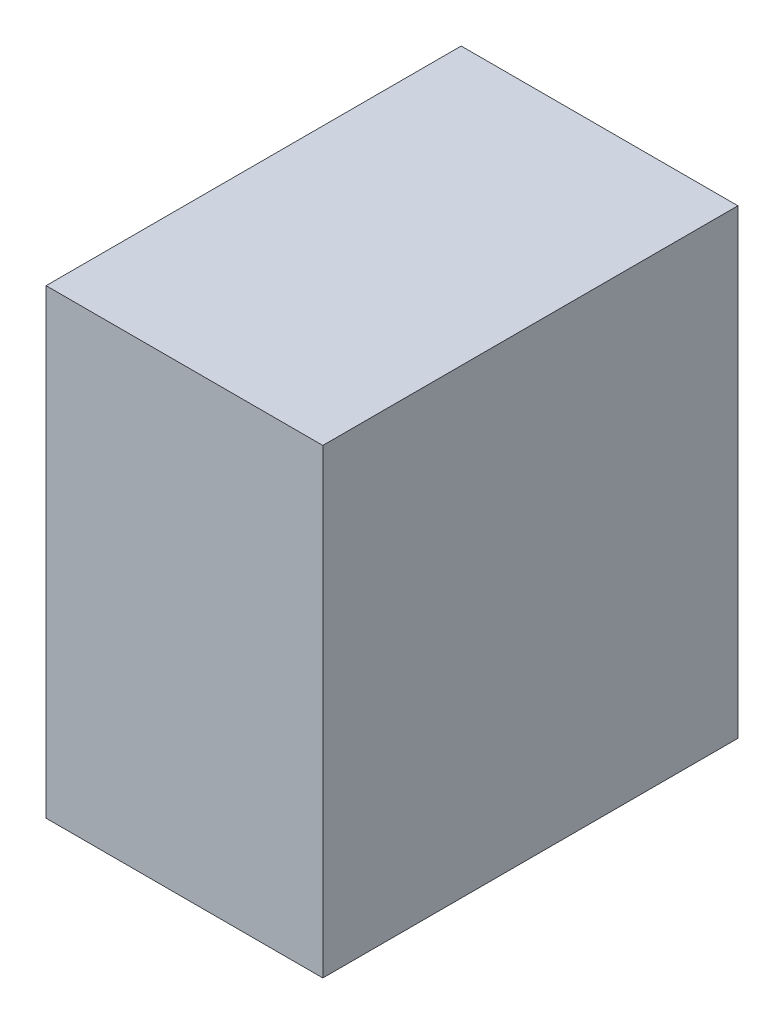
ISO-10303-21;
HEADER;
FILE_DESCRIPTION(('STEP AP214'),'2;1');
FILE_NAME('part.step','',(''),(''),'','','');
FILE_SCHEMA(('AUTOMOTIVE_DESIGN { 1 0 10303 214 1 1 1 1 }'));
ENDSEC;
DATA;
#1=APPLICATION_CONTEXT('core data for automotive mechanical design processes');
#2=APPLICATION_PROTOCOL_DEFINITION('international standard','automotive_design',2000,#1);
#3=PRODUCT_CONTEXT('',#1,'mechanical');
#4=PRODUCT('Part','Part','',(#3));
#5=PRODUCT_RELATED_PRODUCT_CATEGORY('part','',(#4));
#6=PRODUCT_DEFINITION_FORMATION('','',#4);
#7=PRODUCT_DEFINITION_CONTEXT('part definition',#1,'design');
#8=PRODUCT_DEFINITION('design','',#6,#7);
#9=PRODUCT_DEFINITION_SHAPE('','',#8);
#10=(LENGTH_UNIT() NAMED_UNIT(*) SI_UNIT(.MILLI.,.METRE.));
#11=(NAMED_UNIT(*) PLANE_ANGLE_UNIT() SI_UNIT($,.RADIAN.));
#12=(NAMED_UNIT(*) SI_UNIT($,.STERADIAN.) SOLID_ANGLE_UNIT());
#13=UNCERTAINTY_MEASURE_WITH_UNIT(LENGTH_MEASURE(1.E-05),#10,'distance_accuracy_value','');
#14=(GEOMETRIC_REPRESENTATION_CONTEXT(3) GLOBAL_UNCERTAINTY_ASSIGNED_CONTEXT((#13)) GLOBAL_UNIT_ASSIGNED_CONTEXT((#10,
#11,#12)) REPRESENTATION_CONTEXT('',''));
#15=CARTESIAN_POINT('',(0.,0.,0.));
#16=DIRECTION('',(0.,0.,1.));
#17=DIRECTION('',(1.,0.,0.));
#18=AXIS2_PLACEMENT_3D('',#15,#16,#17);
#19=CARTESIAN_POINT('',(3.3,-1.8000002141858,-3.30112167835709));
#20=DIRECTION('',(1.,0.,0.));
#21=DIRECTION('',(0.,1.,8.74227765734759E-08));
#22=AXIS2_PLACEMENT_3D('',#19,#20,#21);
#23=PLANE('',#22);
#24=DIRECTION('',(0.,0.999999999999996,8.74227765733007E-08));
#25=VECTOR('',#24,1.);
#26=CARTESIAN_POINT('',(3.3,-1.75000021855694,-3.25112167398595));
#27=LINE('',#26,#25);
#28=CARTESIAN_POINT('',(3.300000000001,-1.75000021855594,-3.25112167398595));
#29=VERTEX_POINT('',#28);
#30=CARTESIAN_POINT('',(3.300000000001,-0.750000218554942,-3.25112158656218));
#31=VERTEX_POINT('',#30);
#32=EDGE_CURVE('E11',#29,#31,#27,.T.);
#33=ORIENTED_EDGE('',*,*,#32,.F.);
#34=DIRECTION('',(0.,8.7422776672162E-08,-0.999999999999996));
#35=VECTOR('',#34,1.);
#36=CARTESIAN_POINT('',(3.3,-1.75000029723744,-2.35112167398595));
#37=LINE('',#36,#35);
#38=CARTESIAN_POINT('',(3.300000000001,-1.75000029723744,-2.35112167398695));
#39=VERTEX_POINT('',#38);
#40=EDGE_CURVE('E59',#39,#29,#37,.T.);
#41=ORIENTED_EDGE('',*,*,#40,.F.);
#42=DIRECTION('',(0.,-0.999999999999996,-8.74227765733007E-08));
#43=VECTOR('',#42,1.);
#44=CARTESIAN_POINT('',(3.3,-0.75000029723544,-2.35112158656318));
#45=LINE('',#44,#43);
#46=CARTESIAN_POINT('',(3.300000000001,-0.75000029723644,-2.35112158656318));
#47=VERTEX_POINT('',#46);
#48=EDGE_CURVE('E79',#47,#39,#45,.T.);
#49=ORIENTED_EDGE('',*,*,#48,.F.);
#50=DIRECTION('',(0.,-8.74227765488039E-08,0.999999999999996));
#51=VECTOR('',#50,1.);
#52=CARTESIAN_POINT('',(3.3,-0.750000218554942,-3.25112158656318));
#53=LINE('',#52,#51);
#54=EDGE_CURVE('E84',#31,#47,#53,.T.);
#55=ORIENTED_EDGE('',*,*,#54,.F.);
#56=EDGE_LOOP('',(#33,#41,#49,#55));
#57=FACE_BOUND('',#56,.T.);
#58=ADVANCED_FACE('F17',(#57),#23,.F.);
#59=CARTESIAN_POINT('',(3.9,-1.8000002141858,-3.30112167835709));
#60=DIRECTION('',(1.,0.,0.));
#61=DIRECTION('',(0.,1.,8.74227765734759E-08));
#62=AXIS2_PLACEMENT_3D('',#59,#60,#61);
#63=PLANE('',#62);
#64=DIRECTION('',(0.,-8.74227771655945E-08,0.999999999999996));
#65=VECTOR('',#64,1.);
#66=CARTESIAN_POINT('',(3.9,-0.750000218554941,-3.25112158656318));
#67=LINE('',#66,#65);
#68=CARTESIAN_POINT('',(3.899999999999,-0.750000218554942,-3.25112158656218));
#69=VERTEX_POINT('',#68);
#70=CARTESIAN_POINT('',(3.899999999999,-0.75000029723644,-2.35112158656318));
#71=VERTEX_POINT('',#70);
#72=EDGE_CURVE('E24',#69,#71,#67,.T.);
#73=ORIENTED_EDGE('',*,*,#72,.T.);
#74=DIRECTION('',(0.,-0.999999999999996,-8.74227765733006E-08));
#75=VECTOR('',#74,1.);
#76=CARTESIAN_POINT('',(3.9,-0.75000029723544,-2.35112158656318));
#77=LINE('',#76,#75);
#78=CARTESIAN_POINT('',(3.899999999999,-1.75000029723744,-2.35112167398695));
#79=VERTEX_POINT('',#78);
#80=EDGE_CURVE('E82',#71,#79,#77,.T.);
#81=ORIENTED_EDGE('',*,*,#80,.T.);
#82=DIRECTION('',(0.,8.7422776672162E-08,-0.999999999999996));
#83=VECTOR('',#82,1.);
#84=CARTESIAN_POINT('',(3.9,-1.75000029723744,-2.35112167398595));
#85=LINE('',#84,#83);
#86=CARTESIAN_POINT('',(3.899999999999,-1.75000021855594,-3.25112167398595));
#87=VERTEX_POINT('',#86);
#88=EDGE_CURVE('E64',#79,#87,#85,.T.);
#89=ORIENTED_EDGE('',*,*,#88,.T.);
#90=DIRECTION('',(0.,0.999999999999996,8.74227765733007E-08));
#91=VECTOR('',#90,1.);
#92=CARTESIAN_POINT('',(3.9,-1.75000021855694,-3.25112167398595));
#93=LINE('',#92,#91);
#94=EDGE_CURVE('E61',#87,#69,#93,.T.);
#95=ORIENTED_EDGE('',*,*,#94,.T.);
#96=EDGE_LOOP('',(#73,#81,#89,#95));
#97=FACE_BOUND('',#96,.T.);
#98=ADVANCED_FACE('F62',(#97),#63,.T.);
#99=CARTESIAN_POINT('',(3.3,-0.750000218554942,-3.25112158656318));
#100=DIRECTION('',(0.,1.,8.74227765734759E-08));
#101=DIRECTION('',(0.,-8.74227765734759E-08,1.));
#102=AXIS2_PLACEMENT_3D('',#99,#100,#101);
#103=PLANE('',#102);
#104=ORIENTED_EDGE('',*,*,#54,.T.);
#105=DIRECTION('',(1.,0.,0.));
#106=VECTOR('',#105,1.);
#107=CARTESIAN_POINT('',(3.3,-0.75000029723544,-2.35112158656318));
#108=LINE('',#107,#106);
#109=EDGE_CURVE('E57',#47,#71,#108,.T.);
#110=ORIENTED_EDGE('',*,*,#109,.T.);
#111=ORIENTED_EDGE('',*,*,#72,.F.);
#112=DIRECTION('',(1.,0.,0.));
#113=VECTOR('',#112,1.);
#114=CARTESIAN_POINT('',(3.3,-0.750000218554941,-3.25112158656318));
#115=LINE('',#114,#113);
#116=EDGE_CURVE('E55',#31,#69,#115,.T.);
#117=ORIENTED_EDGE('',*,*,#116,.F.);
#118=EDGE_LOOP('',(#104,#110,#111,#117));
#119=FACE_BOUND('',#118,.T.);
#120=ADVANCED_FACE('F53',(#119),#103,.T.);
#121=CARTESIAN_POINT('',(3.3,-0.75000029723544,-2.35112158656318));
#122=DIRECTION('',(0.,-8.74227765734759E-08,1.));
#123=DIRECTION('',(0.,-1.,-8.74227765734759E-08));
#124=AXIS2_PLACEMENT_3D('',#121,#122,#123);
#125=PLANE('',#124);
#126=ORIENTED_EDGE('',*,*,#48,.T.);
#127=DIRECTION('',(1.,0.,0.));
#128=VECTOR('',#127,1.);
#129=CARTESIAN_POINT('',(3.3,-1.75000029723744,-2.35112167398595));
#130=LINE('',#129,#128);
#131=EDGE_CURVE('E68',#39,#79,#130,.T.);
#132=ORIENTED_EDGE('',*,*,#131,.T.);
#133=ORIENTED_EDGE('',*,*,#80,.F.);
#134=ORIENTED_EDGE('',*,*,#109,.F.);
#135=EDGE_LOOP('',(#126,#132,#133,#134));
#136=FACE_BOUND('',#135,.T.);
#137=ADVANCED_FACE('F91',(#136),#125,.T.);
#138=CARTESIAN_POINT('',(3.3,-1.75000029723744,-2.35112167398595));
#139=DIRECTION('',(0.,-1.,-8.74227765734759E-08));
#140=DIRECTION('',(0.,8.74227765734759E-08,-1.));
#141=AXIS2_PLACEMENT_3D('',#138,#139,#140);
#142=PLANE('',#141);
#143=ORIENTED_EDGE('',*,*,#40,.T.);
#144=DIRECTION('',(1.,0.,0.));
#145=VECTOR('',#144,1.);
#146=CARTESIAN_POINT('',(3.3,-1.75000021855694,-3.25112167398595));
#147=LINE('',#146,#145);
#148=EDGE_CURVE('E69',#29,#87,#147,.T.);
#149=ORIENTED_EDGE('',*,*,#148,.T.);
#150=ORIENTED_EDGE('',*,*,#88,.F.);
#151=ORIENTED_EDGE('',*,*,#131,.F.);
#152=EDGE_LOOP('',(#143,#149,#150,#151));
#153=FACE_BOUND('',#152,.T.);
#154=ADVANCED_FACE('F88',(#153),#142,.T.);
#155=CARTESIAN_POINT('',(3.3,-1.75000021855694,-3.25112167398595));
#156=DIRECTION('',(0.,8.74227765734759E-08,-1.));
#157=DIRECTION('',(0.,1.,8.74227765734759E-08));
#158=AXIS2_PLACEMENT_3D('',#155,#156,#157);
#159=PLANE('',#158);
#160=ORIENTED_EDGE('',*,*,#32,.T.);
#161=ORIENTED_EDGE('',*,*,#116,.T.);
#162=ORIENTED_EDGE('',*,*,#94,.F.);
#163=ORIENTED_EDGE('',*,*,#148,.F.);
#164=EDGE_LOOP('',(#160,#161,#162,#163));
#165=FACE_BOUND('',#164,.T.);
#166=ADVANCED_FACE('F71',(#165),#159,.T.);
#167=CLOSED_SHELL('',(#58,#98,#120,#137,#154,#166));
#168=MANIFOLD_SOLID_BREP('B1',#167);
#169=ADVANCED_BREP_SHAPE_REPRESENTATION('',(#18,#168),#14);
#170=SHAPE_DEFINITION_REPRESENTATION(#9,#169);
ENDSEC;
END-ISO-10303-21;
